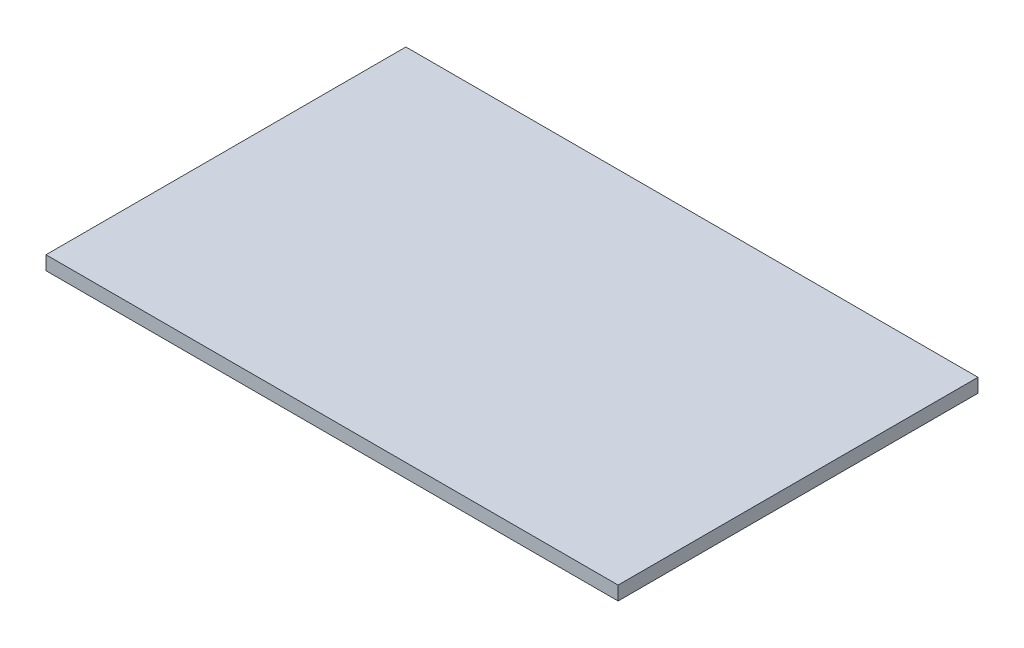
ISO-10303-21;
HEADER;
FILE_DESCRIPTION(('STEP AP214'),'2;1');
FILE_NAME('part.step','',(''),(''),'','','');
FILE_SCHEMA(('AUTOMOTIVE_DESIGN { 1 0 10303 214 1 1 1 1 }'));
ENDSEC;
DATA;
#1=APPLICATION_CONTEXT('core data for automotive mechanical design processes');
#2=APPLICATION_PROTOCOL_DEFINITION('international standard','automotive_design',2000,#1);
#3=PRODUCT_CONTEXT('',#1,'mechanical');
#4=PRODUCT('Part','Part','',(#3));
#5=PRODUCT_RELATED_PRODUCT_CATEGORY('part','',(#4));
#6=PRODUCT_DEFINITION_FORMATION('','',#4);
#7=PRODUCT_DEFINITION_CONTEXT('part definition',#1,'design');
#8=PRODUCT_DEFINITION('design','',#6,#7);
#9=PRODUCT_DEFINITION_SHAPE('','',#8);
#10=(LENGTH_UNIT() NAMED_UNIT(*) SI_UNIT(.MILLI.,.METRE.));
#11=(NAMED_UNIT(*) PLANE_ANGLE_UNIT() SI_UNIT($,.RADIAN.));
#12=(NAMED_UNIT(*) SI_UNIT($,.STERADIAN.) SOLID_ANGLE_UNIT());
#13=UNCERTAINTY_MEASURE_WITH_UNIT(LENGTH_MEASURE(1.E-05),#10,'distance_accuracy_value','');
#14=(GEOMETRIC_REPRESENTATION_CONTEXT(3) GLOBAL_UNCERTAINTY_ASSIGNED_CONTEXT((#13)) GLOBAL_UNIT_ASSIGNED_CONTEXT((#10,
#11,#12)) REPRESENTATION_CONTEXT('',''));
#15=CARTESIAN_POINT('',(0.,0.,0.));
#16=DIRECTION('',(0.,0.,1.));
#17=DIRECTION('',(1.,0.,0.));
#18=AXIS2_PLACEMENT_3D('',#15,#16,#17);
#19=CARTESIAN_POINT('',(0.,19.05,0.));
#20=DIRECTION('',(1.,0.,0.));
#21=DIRECTION('',(0.,0.,-1.));
#22=AXIS2_PLACEMENT_3D('',#19,#20,#21);
#23=PLANE('',#22);
#24=DIRECTION('',(0.,0.,1.));
#25=VECTOR('',#24,1.);
#26=CARTESIAN_POINT('',(0.,0.,0.));
#27=LINE('',#26,#25);
#28=CARTESIAN_POINT('',(0.,0.,-495.3));
#29=VERTEX_POINT('',#28);
#30=CARTESIAN_POINT('',(0.,0.,0.));
#31=VERTEX_POINT('',#30);
#32=EDGE_CURVE('E97',#29,#31,#27,.T.);
#33=ORIENTED_EDGE('',*,*,#32,.T.);
#34=DIRECTION('',(0.,-1.,0.));
#35=VECTOR('',#34,1.);
#36=CARTESIAN_POINT('',(0.,19.05,0.));
#37=LINE('',#36,#35);
#38=CARTESIAN_POINT('',(0.,19.05,0.));
#39=VERTEX_POINT('',#38);
#40=EDGE_CURVE('E11',#39,#31,#37,.T.);
#41=ORIENTED_EDGE('',*,*,#40,.F.);
#42=DIRECTION('',(0.,0.,1.));
#43=VECTOR('',#42,1.);
#44=CARTESIAN_POINT('',(0.,19.05,0.));
#45=LINE('',#44,#43);
#46=CARTESIAN_POINT('',(0.,19.05,-495.3));
#47=VERTEX_POINT('',#46);
#48=EDGE_CURVE('E85',#47,#39,#45,.T.);
#49=ORIENTED_EDGE('',*,*,#48,.F.);
#50=DIRECTION('',(0.,-1.,0.));
#51=VECTOR('',#50,1.);
#52=CARTESIAN_POINT('',(0.,19.05,-495.3));
#53=LINE('',#52,#51);
#54=EDGE_CURVE('E93',#47,#29,#53,.T.);
#55=ORIENTED_EDGE('',*,*,#54,.T.);
#56=EDGE_LOOP('',(#33,#41,#49,#55));
#57=FACE_BOUND('',#56,.T.);
#58=ADVANCED_FACE('F34',(#57),#23,.F.);
#59=CARTESIAN_POINT('',(0.,19.05,0.));
#60=DIRECTION('',(0.,0.,-1.));
#61=DIRECTION('',(-1.,0.,0.));
#62=AXIS2_PLACEMENT_3D('',#59,#60,#61);
#63=PLANE('',#62);
#64=DIRECTION('',(1.,0.,0.));
#65=VECTOR('',#64,1.);
#66=CARTESIAN_POINT('',(0.,0.,0.));
#67=LINE('',#66,#65);
#68=CARTESIAN_POINT('',(787.4,0.,0.));
#69=VERTEX_POINT('',#68);
#70=EDGE_CURVE('E89',#31,#69,#67,.T.);
#71=ORIENTED_EDGE('',*,*,#70,.T.);
#72=DIRECTION('',(0.,-1.,0.));
#73=VECTOR('',#72,1.);
#74=CARTESIAN_POINT('',(787.4,19.05,0.));
#75=LINE('',#74,#73);
#76=CARTESIAN_POINT('',(787.4,19.05,0.));
#77=VERTEX_POINT('',#76);
#78=EDGE_CURVE('E42',#77,#69,#75,.T.);
#79=ORIENTED_EDGE('',*,*,#78,.F.);
#80=DIRECTION('',(1.,0.,0.));
#81=VECTOR('',#80,1.);
#82=CARTESIAN_POINT('',(0.,19.05,0.));
#83=LINE('',#82,#81);
#84=EDGE_CURVE('E80',#39,#77,#83,.T.);
#85=ORIENTED_EDGE('',*,*,#84,.F.);
#86=ORIENTED_EDGE('',*,*,#40,.T.);
#87=EDGE_LOOP('',(#71,#79,#85,#86));
#88=FACE_BOUND('',#87,.T.);
#89=ADVANCED_FACE('F88',(#88),#63,.F.);
#90=CARTESIAN_POINT('',(787.4,19.05,0.));
#91=DIRECTION('',(-1.,0.,0.));
#92=DIRECTION('',(0.,0.,1.));
#93=AXIS2_PLACEMENT_3D('',#90,#91,#92);
#94=PLANE('',#93);
#95=DIRECTION('',(0.,0.,-1.));
#96=VECTOR('',#95,1.);
#97=CARTESIAN_POINT('',(787.4,0.,0.));
#98=LINE('',#97,#96);
#99=CARTESIAN_POINT('',(787.4,0.,-495.3));
#100=VERTEX_POINT('',#99);
#101=EDGE_CURVE('E67',#69,#100,#98,.T.);
#102=ORIENTED_EDGE('',*,*,#101,.T.);
#103=DIRECTION('',(0.,-1.,0.));
#104=VECTOR('',#103,1.);
#105=CARTESIAN_POINT('',(787.4,19.05,-495.3));
#106=LINE('',#105,#104);
#107=CARTESIAN_POINT('',(787.4,19.05,-495.3));
#108=VERTEX_POINT('',#107);
#109=EDGE_CURVE('E90',#108,#100,#106,.T.);
#110=ORIENTED_EDGE('',*,*,#109,.F.);
#111=DIRECTION('',(0.,0.,-1.));
#112=VECTOR('',#111,1.);
#113=CARTESIAN_POINT('',(787.4,19.05,0.));
#114=LINE('',#113,#112);
#115=EDGE_CURVE('E83',#77,#108,#114,.T.);
#116=ORIENTED_EDGE('',*,*,#115,.F.);
#117=ORIENTED_EDGE('',*,*,#78,.T.);
#118=EDGE_LOOP('',(#102,#110,#116,#117));
#119=FACE_BOUND('',#118,.T.);
#120=ADVANCED_FACE('F91',(#119),#94,.F.);
#121=CARTESIAN_POINT('',(0.,19.05,-495.3));
#122=DIRECTION('',(0.,0.,1.));
#123=DIRECTION('',(1.,0.,0.));
#124=AXIS2_PLACEMENT_3D('',#121,#122,#123);
#125=PLANE('',#124);
#126=DIRECTION('',(-1.,0.,0.));
#127=VECTOR('',#126,1.);
#128=CARTESIAN_POINT('',(0.,0.,-495.3));
#129=LINE('',#128,#127);
#130=EDGE_CURVE('E73',#100,#29,#129,.T.);
#131=ORIENTED_EDGE('',*,*,#130,.T.);
#132=ORIENTED_EDGE('',*,*,#54,.F.);
#133=DIRECTION('',(-1.,0.,0.));
#134=VECTOR('',#133,1.);
#135=CARTESIAN_POINT('',(0.,19.05,-495.3));
#136=LINE('',#135,#134);
#137=EDGE_CURVE('E50',#108,#47,#136,.T.);
#138=ORIENTED_EDGE('',*,*,#137,.F.);
#139=ORIENTED_EDGE('',*,*,#109,.T.);
#140=EDGE_LOOP('',(#131,#132,#138,#139));
#141=FACE_BOUND('',#140,.T.);
#142=ADVANCED_FACE('F104',(#141),#125,.F.);
#143=CARTESIAN_POINT('',(0.,19.05,0.));
#144=DIRECTION('',(0.,-1.,0.));
#145=DIRECTION('',(0.,0.,-1.));
#146=AXIS2_PLACEMENT_3D('',#143,#144,#145);
#147=PLANE('',#146);
#148=ORIENTED_EDGE('',*,*,#48,.T.);
#149=ORIENTED_EDGE('',*,*,#84,.T.);
#150=ORIENTED_EDGE('',*,*,#115,.T.);
#151=ORIENTED_EDGE('',*,*,#137,.T.);
#152=EDGE_LOOP('',(#148,#149,#150,#151));
#153=FACE_BOUND('',#152,.T.);
#154=ADVANCED_FACE('F81',(#153),#147,.F.);
#155=CARTESIAN_POINT('',(0.,0.,0.));
#156=DIRECTION('',(0.,-1.,0.));
#157=DIRECTION('',(0.,0.,-1.));
#158=AXIS2_PLACEMENT_3D('',#155,#156,#157);
#159=PLANE('',#158);
#160=ORIENTED_EDGE('',*,*,#32,.F.);
#161=ORIENTED_EDGE('',*,*,#130,.F.);
#162=ORIENTED_EDGE('',*,*,#101,.F.);
#163=ORIENTED_EDGE('',*,*,#70,.F.);
#164=EDGE_LOOP('',(#160,#161,#162,#163));
#165=FACE_BOUND('',#164,.T.);
#166=ADVANCED_FACE('F107',(#165),#159,.T.);
#167=CLOSED_SHELL('',(#58,#89,#120,#142,#154,#166));
#168=MANIFOLD_SOLID_BREP('B2',#167);
#169=ADVANCED_BREP_SHAPE_REPRESENTATION('',(#18,#168),#14);
#170=SHAPE_DEFINITION_REPRESENTATION(#9,#169);
ENDSEC;
END-ISO-10303-21;
